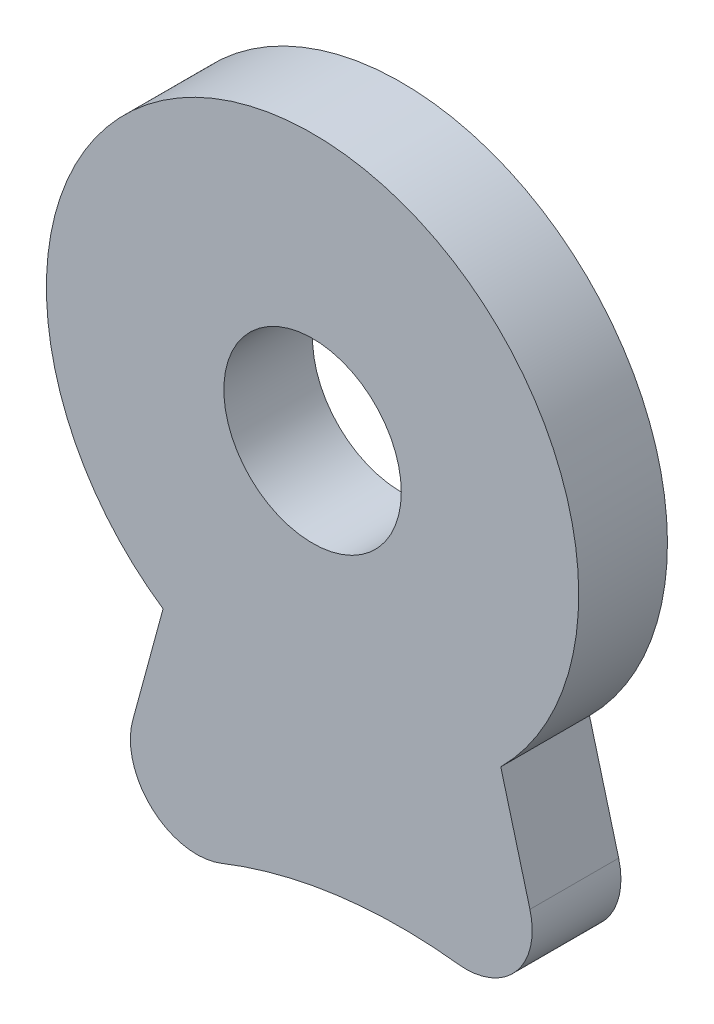
ISO-10303-21;
HEADER;
FILE_DESCRIPTION(('STEP AP214'),'2;1');
FILE_NAME('part.step','',(''),(''),'','','');
FILE_SCHEMA(('AUTOMOTIVE_DESIGN { 1 0 10303 214 1 1 1 1 }'));
ENDSEC;
DATA;
#1=APPLICATION_CONTEXT('core data for automotive mechanical design processes');
#2=APPLICATION_PROTOCOL_DEFINITION('international standard','automotive_design',2000,#1);
#3=PRODUCT_CONTEXT('',#1,'mechanical');
#4=PRODUCT('Part','Part','',(#3));
#5=PRODUCT_RELATED_PRODUCT_CATEGORY('part','',(#4));
#6=PRODUCT_DEFINITION_FORMATION('','',#4);
#7=PRODUCT_DEFINITION_CONTEXT('part definition',#1,'design');
#8=PRODUCT_DEFINITION('design','',#6,#7);
#9=PRODUCT_DEFINITION_SHAPE('','',#8);
#10=(LENGTH_UNIT() NAMED_UNIT(*) SI_UNIT(.MILLI.,.METRE.));
#11=(NAMED_UNIT(*) PLANE_ANGLE_UNIT() SI_UNIT($,.RADIAN.));
#12=(NAMED_UNIT(*) SI_UNIT($,.STERADIAN.) SOLID_ANGLE_UNIT());
#13=UNCERTAINTY_MEASURE_WITH_UNIT(LENGTH_MEASURE(1.E-05),#10,'distance_accuracy_value','');
#14=(GEOMETRIC_REPRESENTATION_CONTEXT(3) GLOBAL_UNCERTAINTY_ASSIGNED_CONTEXT((#13)) GLOBAL_UNIT_ASSIGNED_CONTEXT((#10,
#11,#12)) REPRESENTATION_CONTEXT('',''));
#15=CARTESIAN_POINT('',(0.,0.,0.));
#16=DIRECTION('',(0.,0.,1.));
#17=DIRECTION('',(1.,0.,0.));
#18=AXIS2_PLACEMENT_3D('',#15,#16,#17);
#19=CARTESIAN_POINT('',(-174.416251328011,-25.1721603850015,2.));
#20=DIRECTION('',(0.,0.,-1.));
#21=DIRECTION('',(-1.,0.,0.));
#22=AXIS2_PLACEMENT_3D('',#19,#20,#21);
#23=CYLINDRICAL_SURFACE('',#22,6.00000000000002);
#24=CARTESIAN_POINT('',(-174.416251328011,-25.1721603850015,0.));
#25=DIRECTION('',(0.,0.,1.));
#26=DIRECTION('',(1.,0.,0.));
#27=AXIS2_PLACEMENT_3D('',#24,#25,#26);
#28=CIRCLE('',#27,6.00000000000002);
#29=CARTESIAN_POINT('',(-170.173610641153,-29.4148010723819,0.));
#30=VERTEX_POINT('',#29);
#31=CARTESIAN_POINT('',(-177.78627055048,-30.1363290404956,0.));
#32=VERTEX_POINT('',#31);
#33=EDGE_CURVE('E107',#30,#32,#28,.T.);
#34=ORIENTED_EDGE('',*,*,#33,.T.);
#35=DIRECTION('',(0.,0.,-1.));
#36=VECTOR('',#35,1.);
#37=CARTESIAN_POINT('',(-177.78627055048,-30.1363290404956,2.));
#38=LINE('',#37,#36);
#39=CARTESIAN_POINT('',(-177.78627055048,-30.1363290404956,2.));
#40=VERTEX_POINT('',#39);
#41=EDGE_CURVE('E94',#40,#32,#38,.T.);
#42=ORIENTED_EDGE('',*,*,#41,.F.);
#43=CARTESIAN_POINT('',(-174.416251328011,-25.1721603850015,2.));
#44=DIRECTION('',(0.,0.,1.));
#45=DIRECTION('',(1.,0.,0.));
#46=AXIS2_PLACEMENT_3D('',#43,#44,#45);
#47=CIRCLE('',#46,6.00000000000002);
#48=CARTESIAN_POINT('',(-170.173610641153,-29.4148010723819,2.));
#49=VERTEX_POINT('',#48);
#50=EDGE_CURVE('E98',#49,#40,#47,.T.);
#51=ORIENTED_EDGE('',*,*,#50,.F.);
#52=DIRECTION('',(0.,0.,-1.));
#53=VECTOR('',#52,1.);
#54=CARTESIAN_POINT('',(-170.173610641153,-29.4148010723819,2.));
#55=LINE('',#54,#53);
#56=EDGE_CURVE('E109',#49,#30,#55,.T.);
#57=ORIENTED_EDGE('',*,*,#56,.T.);
#58=EDGE_LOOP('',(#34,#42,#51,#57));
#59=FACE_BOUND('',#58,.T.);
#60=ADVANCED_FACE('F36',(#59),#23,.T.);
#61=CARTESIAN_POINT('',(-157.968634140736,42.8767622426203,2.));
#62=DIRECTION('',(0.96508195176001,-0.261948136826911,0.));
#63=DIRECTION('',(0.261948136826911,0.96508195176001,0.));
#64=AXIS2_PLACEMENT_3D('',#61,#62,#63);
#65=PLANE('',#64);
#66=DIRECTION('',(-0.261948136826911,-0.96508195176001,0.));
#67=VECTOR('',#66,1.);
#68=CARTESIAN_POINT('',(-157.968634140736,42.8767622426203,0.));
#69=LINE('',#68,#67);
#70=CARTESIAN_POINT('',(-178.471059683422,-32.6592621713409,0.));
#71=VERTEX_POINT('',#70);
#72=EDGE_CURVE('E135',#32,#71,#69,.T.);
#73=ORIENTED_EDGE('',*,*,#72,.T.);
#74=DIRECTION('',(0.,0.,-1.));
#75=VECTOR('',#74,1.);
#76=CARTESIAN_POINT('',(-178.471059683422,-32.6592621713409,2.));
#77=LINE('',#76,#75);
#78=CARTESIAN_POINT('',(-178.471059683422,-32.6592621713409,2.));
#79=VERTEX_POINT('',#78);
#80=EDGE_CURVE('E59',#71,#79,#77,.F.);
#81=ORIENTED_EDGE('',*,*,#80,.T.);
#82=DIRECTION('',(-0.261948136826911,-0.96508195176001,0.));
#83=VECTOR('',#82,1.);
#84=CARTESIAN_POINT('',(-157.968634140736,42.8767622426203,2.));
#85=LINE('',#84,#83);
#86=EDGE_CURVE('E90',#40,#79,#85,.T.);
#87=ORIENTED_EDGE('',*,*,#86,.F.);
#88=ORIENTED_EDGE('',*,*,#41,.T.);
#89=EDGE_LOOP('',(#73,#81,#87,#88));
#90=FACE_BOUND('',#89,.T.);
#91=ADVANCED_FACE('F92',(#90),#65,.F.);
#92=CARTESIAN_POINT('',(-172.416251329011,-44.6721603850015,2.));
#93=DIRECTION('',(0.,0.,-1.));
#94=DIRECTION('',(-1.,0.,0.));
#95=AXIS2_PLACEMENT_3D('',#92,#93,#94);
#96=CYLINDRICAL_SURFACE('',#95,10.9999999997165);
#97=CARTESIAN_POINT('',(-172.416251329011,-44.6721603850015,2.));
#98=DIRECTION('',(0.,0.,1.));
#99=DIRECTION('',(1.,0.,0.));
#100=AXIS2_PLACEMENT_3D('',#97,#98,#99);
#101=CIRCLE('',#100,10.9999999997165);
#102=CARTESIAN_POINT('',(-176.470574504557,-34.4465814976233,2.));
#103=VERTEX_POINT('',#102);
#104=CARTESIAN_POINT('',(-171.139188939347,-33.746543164603,2.));
#105=VERTEX_POINT('',#104);
#106=EDGE_CURVE('E97',#103,#105,#101,.F.);
#107=ORIENTED_EDGE('',*,*,#106,.F.);
#108=DIRECTION('',(0.,0.,-1.));
#109=VECTOR('',#108,1.);
#110=CARTESIAN_POINT('',(-176.470574504557,-34.4465814976233,2.));
#111=LINE('',#110,#109);
#112=CARTESIAN_POINT('',(-176.470574504557,-34.4465814976233,0.));
#113=VERTEX_POINT('',#112);
#114=EDGE_CURVE('E111',#103,#113,#111,.T.);
#115=ORIENTED_EDGE('',*,*,#114,.T.);
#116=CARTESIAN_POINT('',(-172.416251329011,-44.6721603850015,0.));
#117=DIRECTION('',(0.,0.,1.));
#118=DIRECTION('',(1.,0.,0.));
#119=AXIS2_PLACEMENT_3D('',#116,#117,#118);
#120=CIRCLE('',#119,10.9999999997165);
#121=CARTESIAN_POINT('',(-171.139188939347,-33.746543164603,0.));
#122=VERTEX_POINT('',#121);
#123=EDGE_CURVE('E136',#113,#122,#120,.F.);
#124=ORIENTED_EDGE('',*,*,#123,.T.);
#125=DIRECTION('',(0.,0.,-1.));
#126=VECTOR('',#125,1.);
#127=CARTESIAN_POINT('',(-171.139188939347,-33.746543164603,2.));
#128=LINE('',#127,#126);
#129=EDGE_CURVE('E108',#122,#105,#128,.F.);
#130=ORIENTED_EDGE('',*,*,#129,.T.);
#131=EDGE_LOOP('',(#107,#115,#124,#130));
#132=FACE_BOUND('',#131,.T.);
#133=ADVANCED_FACE('F127',(#132),#96,.F.);
#134=CARTESIAN_POINT('',(-174.416251328011,-25.1721603850015,2.));
#135=DIRECTION('',(0.,0.,-1.));
#136=DIRECTION('',(-1.,0.,0.));
#137=AXIS2_PLACEMENT_3D('',#134,#135,#136);
#138=CYLINDRICAL_SURFACE('',#137,2.);
#139=CARTESIAN_POINT('',(-174.416251328011,-25.1721603850015,2.));
#140=DIRECTION('',(0.,0.,1.));
#141=DIRECTION('',(1.,0.,0.));
#142=AXIS2_PLACEMENT_3D('',#139,#140,#141);
#143=CIRCLE('',#142,2.);
#144=CARTESIAN_POINT('',(-172.416251328011,-25.1721603850015,2.));
#145=VERTEX_POINT('',#144);
#146=EDGE_CURVE('E104',#145,#145,#143,.T.);
#147=ORIENTED_EDGE('',*,*,#146,.T.);
#148=EDGE_LOOP('',(#147));
#149=FACE_BOUND('',#148,.T.);
#150=CARTESIAN_POINT('',(-174.416251328011,-25.1721603850015,0.));
#151=DIRECTION('',(0.,0.,1.));
#152=DIRECTION('',(1.,0.,0.));
#153=AXIS2_PLACEMENT_3D('',#150,#151,#152);
#154=CIRCLE('',#153,2.);
#155=CARTESIAN_POINT('',(-172.416251328011,-25.1721603850015,0.));
#156=VERTEX_POINT('',#155);
#157=EDGE_CURVE('E140',#156,#156,#154,.T.);
#158=ORIENTED_EDGE('',*,*,#157,.F.);
#159=EDGE_LOOP('',(#158));
#160=FACE_BOUND('',#159,.T.);
#161=ADVANCED_FACE('F154',(#149,#160),#138,.F.);
#162=CARTESIAN_POINT('',(-166.127840527117,-44.5138206977246,2.));
#163=DIRECTION('',(0.965925826306283,0.258819045038276,0.));
#164=DIRECTION('',(-0.258819045038276,0.965925826306283,0.));
#165=AXIS2_PLACEMENT_3D('',#162,#163,#164);
#166=PLANE('',#165);
#167=DIRECTION('',(0.258819045038276,-0.965925826306283,0.));
#168=VECTOR('',#167,1.);
#169=CARTESIAN_POINT('',(-166.127840527117,-44.5138206977246,2.));
#170=LINE('',#169,#168);
#171=CARTESIAN_POINT('',(-169.516155328565,-31.8684577033164,2.));
#172=VERTEX_POINT('',#171);
#173=EDGE_CURVE('E102',#49,#172,#170,.T.);
#174=ORIENTED_EDGE('',*,*,#173,.T.);
#175=DIRECTION('',(0.,0.,1.));
#176=VECTOR('',#175,1.);
#177=CARTESIAN_POINT('',(-169.516155328565,-31.8684577033164,0.));
#178=LINE('',#177,#176);
#179=CARTESIAN_POINT('',(-169.516155328565,-31.8684577033164,0.));
#180=VERTEX_POINT('',#179);
#181=EDGE_CURVE('E11',#172,#180,#178,.F.);
#182=ORIENTED_EDGE('',*,*,#181,.T.);
#183=DIRECTION('',(0.258819045038276,-0.965925826306283,0.));
#184=VECTOR('',#183,1.);
#185=CARTESIAN_POINT('',(-166.127840527117,-44.5138206977246,0.));
#186=LINE('',#185,#184);
#187=EDGE_CURVE('E138',#30,#180,#186,.T.);
#188=ORIENTED_EDGE('',*,*,#187,.F.);
#189=ORIENTED_EDGE('',*,*,#56,.F.);
#190=EDGE_LOOP('',(#174,#182,#188,#189));
#191=FACE_BOUND('',#190,.T.);
#192=ADVANCED_FACE('F156',(#191),#166,.T.);
#193=CARTESIAN_POINT('',(0.,0.,2.));
#194=DIRECTION('',(0.,0.,1.));
#195=DIRECTION('',(1.,0.,0.));
#196=AXIS2_PLACEMENT_3D('',#193,#194,#195);
#197=PLANE('',#196);
#198=ORIENTED_EDGE('',*,*,#146,.F.);
#199=EDGE_LOOP('',(#198));
#200=FACE_BOUND('',#199,.T.);
#201=ORIENTED_EDGE('',*,*,#86,.T.);
#202=CARTESIAN_POINT('',(-177.023436755782,-33.0521843765813,2.));
#203=DIRECTION('',(0.,0.,1.));
#204=DIRECTION('',(1.,0.,0.));
#205=AXIS2_PLACEMENT_3D('',#202,#203,#204);
#206=CIRCLE('',#205,1.5);
#207=EDGE_CURVE('E44',#79,#103,#206,.T.);
#208=ORIENTED_EDGE('',*,*,#207,.T.);
#209=ORIENTED_EDGE('',*,*,#106,.T.);
#210=CARTESIAN_POINT('',(-170.965044068025,-32.2566862708739,2.));
#211=DIRECTION('',(0.,0.,1.));
#212=DIRECTION('',(1.,0.,0.));
#213=AXIS2_PLACEMENT_3D('',#210,#211,#212);
#214=CIRCLE('',#213,1.5);
#215=EDGE_CURVE('E51',#105,#172,#214,.T.);
#216=ORIENTED_EDGE('',*,*,#215,.T.);
#217=ORIENTED_EDGE('',*,*,#173,.F.);
#218=ORIENTED_EDGE('',*,*,#50,.T.);
#219=EDGE_LOOP('',(#201,#208,#209,#216,#217,#218));
#220=FACE_BOUND('',#219,.T.);
#221=ADVANCED_FACE('F101',(#200,#220),#197,.T.);
#222=CARTESIAN_POINT('',(0.,0.,0.));
#223=DIRECTION('',(0.,0.,1.));
#224=DIRECTION('',(1.,0.,0.));
#225=AXIS2_PLACEMENT_3D('',#222,#223,#224);
#226=PLANE('',#225);
#227=ORIENTED_EDGE('',*,*,#157,.T.);
#228=EDGE_LOOP('',(#227));
#229=FACE_BOUND('',#228,.T.);
#230=ORIENTED_EDGE('',*,*,#123,.F.);
#231=CARTESIAN_POINT('',(-177.023436755782,-33.0521843765813,0.));
#232=DIRECTION('',(0.,0.,1.));
#233=DIRECTION('',(1.,0.,0.));
#234=AXIS2_PLACEMENT_3D('',#231,#232,#233);
#235=CIRCLE('',#234,1.5);
#236=EDGE_CURVE('E120',#113,#71,#235,.F.);
#237=ORIENTED_EDGE('',*,*,#236,.T.);
#238=ORIENTED_EDGE('',*,*,#72,.F.);
#239=ORIENTED_EDGE('',*,*,#33,.F.);
#240=ORIENTED_EDGE('',*,*,#187,.T.);
#241=CARTESIAN_POINT('',(-170.965044068025,-32.2566862708739,0.));
#242=DIRECTION('',(0.,0.,1.));
#243=DIRECTION('',(1.,0.,0.));
#244=AXIS2_PLACEMENT_3D('',#241,#242,#243);
#245=CIRCLE('',#244,1.5);
#246=EDGE_CURVE('E118',#180,#122,#245,.F.);
#247=ORIENTED_EDGE('',*,*,#246,.T.);
#248=EDGE_LOOP('',(#230,#237,#238,#239,#240,#247));
#249=FACE_BOUND('',#248,.T.);
#250=ADVANCED_FACE('F134',(#229,#249),#226,.F.);
#251=CARTESIAN_POINT('',(-177.023436755782,-33.0521843765813,2.));
#252=DIRECTION('',(0.,0.,-1.));
#253=DIRECTION('',(-1.,0.,0.));
#254=AXIS2_PLACEMENT_3D('',#251,#252,#253);
#255=CYLINDRICAL_SURFACE('',#254,1.5);
#256=ORIENTED_EDGE('',*,*,#207,.F.);
#257=ORIENTED_EDGE('',*,*,#80,.F.);
#258=ORIENTED_EDGE('',*,*,#236,.F.);
#259=ORIENTED_EDGE('',*,*,#114,.F.);
#260=EDGE_LOOP('',(#256,#257,#258,#259));
#261=FACE_BOUND('',#260,.T.);
#262=ADVANCED_FACE('F132',(#261),#255,.T.);
#263=CARTESIAN_POINT('',(-170.965044068025,-32.2566862708739,2.));
#264=DIRECTION('',(0.,0.,-1.));
#265=DIRECTION('',(-1.,0.,0.));
#266=AXIS2_PLACEMENT_3D('',#263,#264,#265);
#267=CYLINDRICAL_SURFACE('',#266,1.5);
#268=ORIENTED_EDGE('',*,*,#215,.F.);
#269=ORIENTED_EDGE('',*,*,#129,.F.);
#270=ORIENTED_EDGE('',*,*,#246,.F.);
#271=ORIENTED_EDGE('',*,*,#181,.F.);
#272=EDGE_LOOP('',(#268,#269,#270,#271));
#273=FACE_BOUND('',#272,.T.);
#274=ADVANCED_FACE('F38',(#273),#267,.T.);
#275=CLOSED_SHELL('',(#60,#91,#133,#161,#192,#221,#250,#262,#274));
#276=MANIFOLD_SOLID_BREP('B2',#275);
#277=ADVANCED_BREP_SHAPE_REPRESENTATION('',(#18,#276),#14);
#278=SHAPE_DEFINITION_REPRESENTATION(#9,#277);
ENDSEC;
END-ISO-10303-21;
